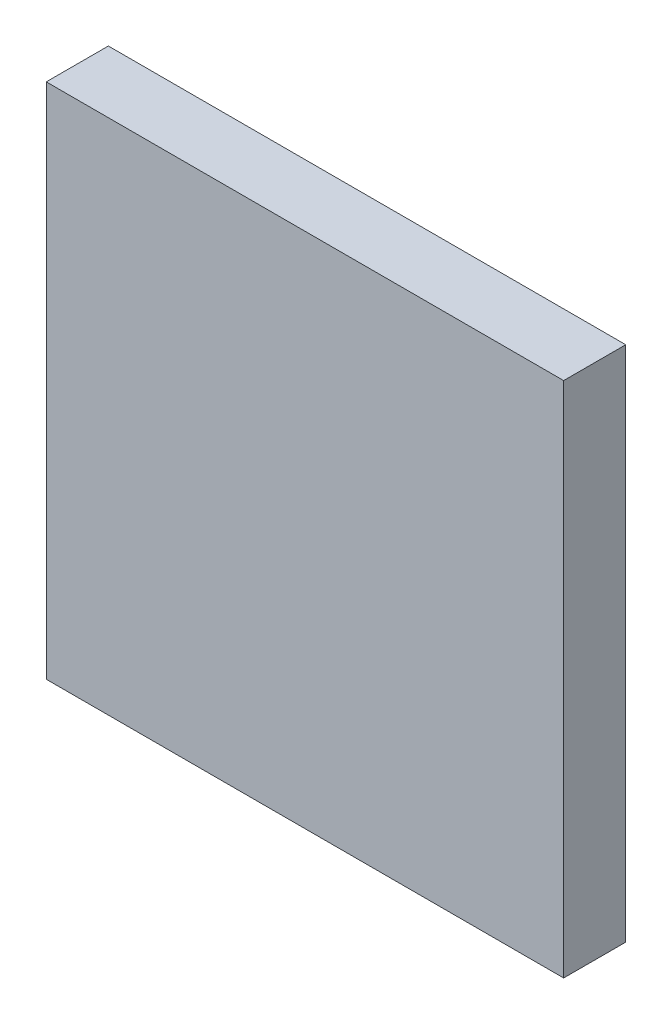
ISO-10303-21;
HEADER;
FILE_DESCRIPTION(('STEP AP214'),'2;1');
FILE_NAME('part.step','',(''),(''),'','','');
FILE_SCHEMA(('AUTOMOTIVE_DESIGN { 1 0 10303 214 1 1 1 1 }'));
ENDSEC;
DATA;
#1=APPLICATION_CONTEXT('core data for automotive mechanical design processes');
#2=APPLICATION_PROTOCOL_DEFINITION('international standard','automotive_design',2000,#1);
#3=PRODUCT_CONTEXT('',#1,'mechanical');
#4=PRODUCT('Part','Part','',(#3));
#5=PRODUCT_RELATED_PRODUCT_CATEGORY('part','',(#4));
#6=PRODUCT_DEFINITION_FORMATION('','',#4);
#7=PRODUCT_DEFINITION_CONTEXT('part definition',#1,'design');
#8=PRODUCT_DEFINITION('design','',#6,#7);
#9=PRODUCT_DEFINITION_SHAPE('','',#8);
#10=(LENGTH_UNIT() NAMED_UNIT(*) SI_UNIT(.MILLI.,.METRE.));
#11=(NAMED_UNIT(*) PLANE_ANGLE_UNIT() SI_UNIT($,.RADIAN.));
#12=(NAMED_UNIT(*) SI_UNIT($,.STERADIAN.) SOLID_ANGLE_UNIT());
#13=UNCERTAINTY_MEASURE_WITH_UNIT(LENGTH_MEASURE(1.E-05),#10,'distance_accuracy_value','');
#14=(GEOMETRIC_REPRESENTATION_CONTEXT(3) GLOBAL_UNCERTAINTY_ASSIGNED_CONTEXT((#13)) GLOBAL_UNIT_ASSIGNED_CONTEXT((#10,
#11,#12)) REPRESENTATION_CONTEXT('',''));
#15=CARTESIAN_POINT('',(0.,0.,0.));
#16=DIRECTION('',(0.,0.,1.));
#17=DIRECTION('',(1.,0.,0.));
#18=AXIS2_PLACEMENT_3D('',#15,#16,#17);
#19=CARTESIAN_POINT('',(-21.3443396226415,29.0683962264151,6.));
#20=DIRECTION('',(1.,0.,0.));
#21=DIRECTION('',(0.,1.,0.));
#22=AXIS2_PLACEMENT_3D('',#19,#20,#21);
#23=PLANE('',#22);
#24=DIRECTION('',(0.,-1.,0.));
#25=VECTOR('',#24,1.);
#26=CARTESIAN_POINT('',(-21.3443396226415,29.0683962264151,0.));
#27=LINE('',#26,#25);
#28=CARTESIAN_POINT('',(-21.3443396226415,29.0683962264151,0.));
#29=VERTEX_POINT('',#28);
#30=CARTESIAN_POINT('',(-21.3443396226415,-20.9316037735849,0.));
#31=VERTEX_POINT('',#30);
#32=EDGE_CURVE('E107',#29,#31,#27,.T.);
#33=ORIENTED_EDGE('',*,*,#32,.T.);
#34=DIRECTION('',(0.,0.,-1.));
#35=VECTOR('',#34,1.);
#36=CARTESIAN_POINT('',(-21.3443396226415,-20.9316037735849,6.));
#37=LINE('',#36,#35);
#38=CARTESIAN_POINT('',(-21.3443396226415,-20.9316037735849,6.));
#39=VERTEX_POINT('',#38);
#40=EDGE_CURVE('E11',#39,#31,#37,.T.);
#41=ORIENTED_EDGE('',*,*,#40,.F.);
#42=DIRECTION('',(0.,-1.,0.));
#43=VECTOR('',#42,1.);
#44=CARTESIAN_POINT('',(-21.3443396226415,29.0683962264151,6.));
#45=LINE('',#44,#43);
#46=CARTESIAN_POINT('',(-21.3443396226415,29.0683962264151,6.));
#47=VERTEX_POINT('',#46);
#48=EDGE_CURVE('E91',#47,#39,#45,.T.);
#49=ORIENTED_EDGE('',*,*,#48,.F.);
#50=DIRECTION('',(0.,0.,-1.));
#51=VECTOR('',#50,1.);
#52=CARTESIAN_POINT('',(-21.3443396226415,29.0683962264151,6.));
#53=LINE('',#52,#51);
#54=EDGE_CURVE('E103',#47,#29,#53,.T.);
#55=ORIENTED_EDGE('',*,*,#54,.T.);
#56=EDGE_LOOP('',(#33,#41,#49,#55));
#57=FACE_BOUND('',#56,.T.);
#58=ADVANCED_FACE('F39',(#57),#23,.F.);
#59=CARTESIAN_POINT('',(-21.3443396226415,-20.9316037735849,6.));
#60=DIRECTION('',(0.,1.,0.));
#61=DIRECTION('',(0.,0.,1.));
#62=AXIS2_PLACEMENT_3D('',#59,#60,#61);
#63=PLANE('',#62);
#64=DIRECTION('',(1.,0.,0.));
#65=VECTOR('',#64,1.);
#66=CARTESIAN_POINT('',(-21.3443396226415,-20.9316037735849,0.));
#67=LINE('',#66,#65);
#68=CARTESIAN_POINT('',(28.6556603773585,-20.9316037735849,0.));
#69=VERTEX_POINT('',#68);
#70=EDGE_CURVE('E96',#31,#69,#67,.T.);
#71=ORIENTED_EDGE('',*,*,#70,.T.);
#72=DIRECTION('',(0.,0.,-1.));
#73=VECTOR('',#72,1.);
#74=CARTESIAN_POINT('',(28.6556603773585,-20.9316037735849,6.));
#75=LINE('',#74,#73);
#76=CARTESIAN_POINT('',(28.6556603773585,-20.9316037735849,6.));
#77=VERTEX_POINT('',#76);
#78=EDGE_CURVE('E48',#77,#69,#75,.T.);
#79=ORIENTED_EDGE('',*,*,#78,.F.);
#80=DIRECTION('',(1.,0.,0.));
#81=VECTOR('',#80,1.);
#82=CARTESIAN_POINT('',(-21.3443396226415,-20.9316037735849,6.));
#83=LINE('',#82,#81);
#84=EDGE_CURVE('E86',#39,#77,#83,.T.);
#85=ORIENTED_EDGE('',*,*,#84,.F.);
#86=ORIENTED_EDGE('',*,*,#40,.T.);
#87=EDGE_LOOP('',(#71,#79,#85,#86));
#88=FACE_BOUND('',#87,.T.);
#89=ADVANCED_FACE('F95',(#88),#63,.F.);
#90=CARTESIAN_POINT('',(28.6556603773585,29.0683962264151,6.));
#91=DIRECTION('',(-1.,0.,0.));
#92=DIRECTION('',(0.,-1.,0.));
#93=AXIS2_PLACEMENT_3D('',#90,#91,#92);
#94=PLANE('',#93);
#95=DIRECTION('',(0.,1.,0.));
#96=VECTOR('',#95,1.);
#97=CARTESIAN_POINT('',(28.6556603773585,29.0683962264151,0.));
#98=LINE('',#97,#96);
#99=CARTESIAN_POINT('',(28.6556603773585,29.0683962264151,0.));
#100=VERTEX_POINT('',#99);
#101=EDGE_CURVE('E73',#69,#100,#98,.T.);
#102=ORIENTED_EDGE('',*,*,#101,.T.);
#103=DIRECTION('',(0.,0.,-1.));
#104=VECTOR('',#103,1.);
#105=CARTESIAN_POINT('',(28.6556603773585,29.0683962264151,6.));
#106=LINE('',#105,#104);
#107=CARTESIAN_POINT('',(28.6556603773585,29.0683962264151,6.));
#108=VERTEX_POINT('',#107);
#109=EDGE_CURVE('E98',#108,#100,#106,.T.);
#110=ORIENTED_EDGE('',*,*,#109,.F.);
#111=DIRECTION('',(0.,1.,0.));
#112=VECTOR('',#111,1.);
#113=CARTESIAN_POINT('',(28.6556603773585,29.0683962264151,6.));
#114=LINE('',#113,#112);
#115=EDGE_CURVE('E89',#77,#108,#114,.T.);
#116=ORIENTED_EDGE('',*,*,#115,.F.);
#117=ORIENTED_EDGE('',*,*,#78,.T.);
#118=EDGE_LOOP('',(#102,#110,#116,#117));
#119=FACE_BOUND('',#118,.T.);
#120=ADVANCED_FACE('F99',(#119),#94,.F.);
#121=CARTESIAN_POINT('',(-21.3443396226415,29.0683962264151,6.));
#122=DIRECTION('',(0.,-1.,0.));
#123=DIRECTION('',(0.,0.,-1.));
#124=AXIS2_PLACEMENT_3D('',#121,#122,#123);
#125=PLANE('',#124);
#126=DIRECTION('',(-1.,0.,0.));
#127=VECTOR('',#126,1.);
#128=CARTESIAN_POINT('',(-21.3443396226415,29.0683962264151,0.));
#129=LINE('',#128,#127);
#130=EDGE_CURVE('E79',#100,#29,#129,.T.);
#131=ORIENTED_EDGE('',*,*,#130,.T.);
#132=ORIENTED_EDGE('',*,*,#54,.F.);
#133=DIRECTION('',(-1.,0.,0.));
#134=VECTOR('',#133,1.);
#135=CARTESIAN_POINT('',(-21.3443396226415,29.0683962264151,6.));
#136=LINE('',#135,#134);
#137=EDGE_CURVE('E56',#108,#47,#136,.T.);
#138=ORIENTED_EDGE('',*,*,#137,.F.);
#139=ORIENTED_EDGE('',*,*,#109,.T.);
#140=EDGE_LOOP('',(#131,#132,#138,#139));
#141=FACE_BOUND('',#140,.T.);
#142=ADVANCED_FACE('F120',(#141),#125,.F.);
#143=CARTESIAN_POINT('',(0.,0.,6.));
#144=DIRECTION('',(0.,0.,1.));
#145=DIRECTION('',(1.,0.,0.));
#146=AXIS2_PLACEMENT_3D('',#143,#144,#145);
#147=PLANE('',#146);
#148=ORIENTED_EDGE('',*,*,#48,.T.);
#149=ORIENTED_EDGE('',*,*,#84,.T.);
#150=ORIENTED_EDGE('',*,*,#115,.T.);
#151=ORIENTED_EDGE('',*,*,#137,.T.);
#152=EDGE_LOOP('',(#148,#149,#150,#151));
#153=FACE_BOUND('',#152,.T.);
#154=ADVANCED_FACE('F87',(#153),#147,.T.);
#155=CARTESIAN_POINT('',(0.,0.,0.));
#156=DIRECTION('',(0.,0.,1.));
#157=DIRECTION('',(1.,0.,0.));
#158=AXIS2_PLACEMENT_3D('',#155,#156,#157);
#159=PLANE('',#158);
#160=ORIENTED_EDGE('',*,*,#32,.F.);
#161=ORIENTED_EDGE('',*,*,#130,.F.);
#162=ORIENTED_EDGE('',*,*,#101,.F.);
#163=ORIENTED_EDGE('',*,*,#70,.F.);
#164=EDGE_LOOP('',(#160,#161,#162,#163));
#165=FACE_BOUND('',#164,.T.);
#166=ADVANCED_FACE('F123',(#165),#159,.F.);
#167=CLOSED_SHELL('',(#58,#89,#120,#142,#154,#166));
#168=MANIFOLD_SOLID_BREP('B2',#167);
#169=ADVANCED_BREP_SHAPE_REPRESENTATION('',(#18,#168),#14);
#170=SHAPE_DEFINITION_REPRESENTATION(#9,#169);
ENDSEC;
END-ISO-10303-21;
